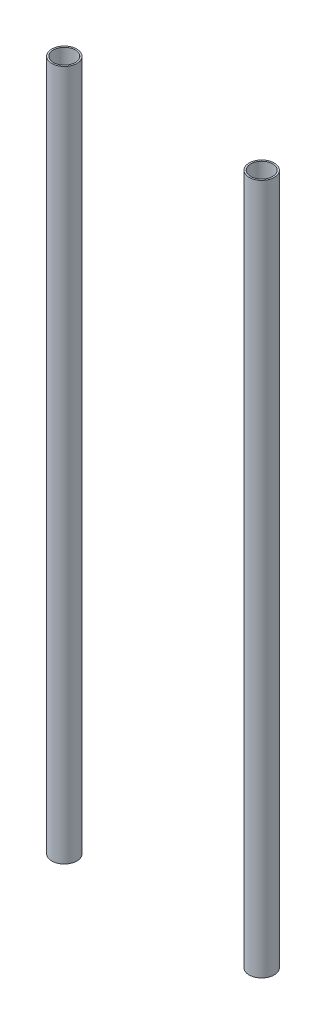
ISO-10303-21;
HEADER;
FILE_DESCRIPTION(('STEP AP214'),'2;1');
FILE_NAME('part.step','',(''),(''),'','','');
FILE_SCHEMA(('AUTOMOTIVE_DESIGN { 1 0 10303 214 1 1 1 1 }'));
ENDSEC;
DATA;
#1=APPLICATION_CONTEXT('core data for automotive mechanical design processes');
#2=APPLICATION_PROTOCOL_DEFINITION('international standard','automotive_design',2000,#1);
#3=PRODUCT_CONTEXT('',#1,'mechanical');
#4=PRODUCT('Part','Part','',(#3));
#5=PRODUCT_RELATED_PRODUCT_CATEGORY('part','',(#4));
#6=PRODUCT_DEFINITION_FORMATION('','',#4);
#7=PRODUCT_DEFINITION_CONTEXT('part definition',#1,'design');
#8=PRODUCT_DEFINITION('design','',#6,#7);
#9=PRODUCT_DEFINITION_SHAPE('','',#8);
#10=(LENGTH_UNIT() NAMED_UNIT(*) SI_UNIT(.MILLI.,.METRE.));
#11=(NAMED_UNIT(*) PLANE_ANGLE_UNIT() SI_UNIT($,.RADIAN.));
#12=(NAMED_UNIT(*) SI_UNIT($,.STERADIAN.) SOLID_ANGLE_UNIT());
#13=UNCERTAINTY_MEASURE_WITH_UNIT(LENGTH_MEASURE(1.E-05),#10,'distance_accuracy_value','');
#14=(GEOMETRIC_REPRESENTATION_CONTEXT(3) GLOBAL_UNCERTAINTY_ASSIGNED_CONTEXT((#13)) GLOBAL_UNIT_ASSIGNED_CONTEXT((#10,
#11,#12)) REPRESENTATION_CONTEXT('',''));
#15=CARTESIAN_POINT('',(0.,0.,0.));
#16=DIRECTION('',(0.,0.,1.));
#17=DIRECTION('',(1.,0.,0.));
#18=AXIS2_PLACEMENT_3D('',#15,#16,#17);
#19=CARTESIAN_POINT('',(100.,700.,0.));
#20=DIRECTION('',(0.,1.,0.));
#21=DIRECTION('',(0.,0.,1.));
#22=AXIS2_PLACEMENT_3D('',#19,#20,#21);
#23=PLANE('',#22);
#24=CARTESIAN_POINT('',(100.,700.,0.));
#25=DIRECTION('',(0.,1.,0.));
#26=DIRECTION('',(0.,0.,1.));
#27=AXIS2_PLACEMENT_3D('',#24,#25,#26);
#28=CIRCLE('',#27,12.7);
#29=CARTESIAN_POINT('',(100.,700.,12.7));
#30=VERTEX_POINT('',#29);
#31=EDGE_CURVE('E11',#30,#30,#28,.T.);
#32=ORIENTED_EDGE('',*,*,#31,.T.);
#33=EDGE_LOOP('',(#32));
#34=FACE_BOUND('',#33,.T.);
#35=CARTESIAN_POINT('',(100.,700.,0.));
#36=DIRECTION('',(0.,1.,0.));
#37=DIRECTION('',(0.,0.,1.));
#38=AXIS2_PLACEMENT_3D('',#35,#36,#37);
#39=CIRCLE('',#38,11.1);
#40=CARTESIAN_POINT('',(100.,700.,11.1));
#41=VERTEX_POINT('',#40);
#42=EDGE_CURVE('E52',#41,#41,#39,.T.);
#43=ORIENTED_EDGE('',*,*,#42,.F.);
#44=EDGE_LOOP('',(#43));
#45=FACE_BOUND('',#44,.T.);
#46=ADVANCED_FACE('F41',(#34,#45),#23,.T.);
#47=CARTESIAN_POINT('',(100.,0.,0.));
#48=DIRECTION('',(0.,1.,0.));
#49=DIRECTION('',(0.,0.,1.));
#50=AXIS2_PLACEMENT_3D('',#47,#48,#49);
#51=PLANE('',#50);
#52=CARTESIAN_POINT('',(100.,0.,0.));
#53=DIRECTION('',(0.,1.,0.));
#54=DIRECTION('',(0.,0.,1.));
#55=AXIS2_PLACEMENT_3D('',#52,#53,#54);
#56=CIRCLE('',#55,12.7);
#57=CARTESIAN_POINT('',(100.,0.,12.7));
#58=VERTEX_POINT('',#57);
#59=EDGE_CURVE('E45',#58,#58,#56,.T.);
#60=ORIENTED_EDGE('',*,*,#59,.F.);
#61=EDGE_LOOP('',(#60));
#62=FACE_BOUND('',#61,.T.);
#63=CARTESIAN_POINT('',(100.,0.,0.));
#64=DIRECTION('',(0.,1.,0.));
#65=DIRECTION('',(0.,0.,1.));
#66=AXIS2_PLACEMENT_3D('',#63,#64,#65);
#67=CIRCLE('',#66,11.1);
#68=CARTESIAN_POINT('',(100.,0.,11.1));
#69=VERTEX_POINT('',#68);
#70=EDGE_CURVE('E54',#69,#69,#67,.T.);
#71=ORIENTED_EDGE('',*,*,#70,.T.);
#72=EDGE_LOOP('',(#71));
#73=FACE_BOUND('',#72,.T.);
#74=ADVANCED_FACE('F64',(#62,#73),#51,.F.);
#75=CARTESIAN_POINT('',(100.,700.,0.));
#76=DIRECTION('',(0.,-1.,0.));
#77=DIRECTION('',(0.,0.,-1.));
#78=AXIS2_PLACEMENT_3D('',#75,#76,#77);
#79=CYLINDRICAL_SURFACE('',#78,12.7);
#80=ORIENTED_EDGE('',*,*,#31,.F.);
#81=EDGE_LOOP('',(#80));
#82=FACE_BOUND('',#81,.T.);
#83=ORIENTED_EDGE('',*,*,#59,.T.);
#84=EDGE_LOOP('',(#83));
#85=FACE_BOUND('',#84,.T.);
#86=ADVANCED_FACE('F43',(#82,#85),#79,.T.);
#87=CARTESIAN_POINT('',(100.,700.,0.));
#88=DIRECTION('',(0.,-1.,0.));
#89=DIRECTION('',(0.,0.,-1.));
#90=AXIS2_PLACEMENT_3D('',#87,#88,#89);
#91=CYLINDRICAL_SURFACE('',#90,11.1);
#92=ORIENTED_EDGE('',*,*,#42,.T.);
#93=EDGE_LOOP('',(#92));
#94=FACE_BOUND('',#93,.T.);
#95=ORIENTED_EDGE('',*,*,#70,.F.);
#96=EDGE_LOOP('',(#95));
#97=FACE_BOUND('',#96,.T.);
#98=ADVANCED_FACE('F60',(#94,#97),#91,.F.);
#99=CLOSED_SHELL('',(#46,#74,#86,#98));
#100=MANIFOLD_SOLID_BREP('B2',#99);
#101=CARTESIAN_POINT('',(-100.,700.,0.));
#102=DIRECTION('',(0.,1.,0.));
#103=DIRECTION('',(0.,0.,1.));
#104=AXIS2_PLACEMENT_3D('',#101,#102,#103);
#105=PLANE('',#104);
#106=CARTESIAN_POINT('',(-100.,700.,0.));
#107=DIRECTION('',(0.,1.,0.));
#108=DIRECTION('',(0.,0.,1.));
#109=AXIS2_PLACEMENT_3D('',#106,#107,#108);
#110=CIRCLE('',#109,12.7);
#111=CARTESIAN_POINT('',(-100.,700.,12.7));
#112=VERTEX_POINT('',#111);
#113=EDGE_CURVE('E40',#112,#112,#110,.T.);
#114=ORIENTED_EDGE('',*,*,#113,.T.);
#115=EDGE_LOOP('',(#114));
#116=FACE_BOUND('',#115,.T.);
#117=CARTESIAN_POINT('',(-100.,700.,0.));
#118=DIRECTION('',(0.,1.,0.));
#119=DIRECTION('',(0.,0.,1.));
#120=AXIS2_PLACEMENT_3D('',#117,#118,#119);
#121=CIRCLE('',#120,11.1);
#122=CARTESIAN_POINT('',(-100.,700.,11.1));
#123=VERTEX_POINT('',#122);
#124=EDGE_CURVE('E116',#123,#123,#121,.T.);
#125=ORIENTED_EDGE('',*,*,#124,.F.);
#126=EDGE_LOOP('',(#125));
#127=FACE_BOUND('',#126,.T.);
#128=ADVANCED_FACE('F105',(#116,#127),#105,.T.);
#129=CARTESIAN_POINT('',(-100.,0.,0.));
#130=DIRECTION('',(0.,1.,0.));
#131=DIRECTION('',(0.,0.,1.));
#132=AXIS2_PLACEMENT_3D('',#129,#130,#131);
#133=PLANE('',#132);
#134=CARTESIAN_POINT('',(-100.,0.,0.));
#135=DIRECTION('',(0.,1.,0.));
#136=DIRECTION('',(0.,0.,1.));
#137=AXIS2_PLACEMENT_3D('',#134,#135,#136);
#138=CIRCLE('',#137,12.7);
#139=CARTESIAN_POINT('',(-100.,0.,12.7));
#140=VERTEX_POINT('',#139);
#141=EDGE_CURVE('E109',#140,#140,#138,.T.);
#142=ORIENTED_EDGE('',*,*,#141,.F.);
#143=EDGE_LOOP('',(#142));
#144=FACE_BOUND('',#143,.T.);
#145=CARTESIAN_POINT('',(-100.,0.,0.));
#146=DIRECTION('',(0.,1.,0.));
#147=DIRECTION('',(0.,0.,1.));
#148=AXIS2_PLACEMENT_3D('',#145,#146,#147);
#149=CIRCLE('',#148,11.1);
#150=CARTESIAN_POINT('',(-100.,0.,11.1));
#151=VERTEX_POINT('',#150);
#152=EDGE_CURVE('E118',#151,#151,#149,.T.);
#153=ORIENTED_EDGE('',*,*,#152,.T.);
#154=EDGE_LOOP('',(#153));
#155=FACE_BOUND('',#154,.T.);
#156=ADVANCED_FACE('F128',(#144,#155),#133,.F.);
#157=CARTESIAN_POINT('',(-100.,700.,0.));
#158=DIRECTION('',(0.,-1.,0.));
#159=DIRECTION('',(0.,0.,-1.));
#160=AXIS2_PLACEMENT_3D('',#157,#158,#159);
#161=CYLINDRICAL_SURFACE('',#160,12.7);
#162=ORIENTED_EDGE('',*,*,#113,.F.);
#163=EDGE_LOOP('',(#162));
#164=FACE_BOUND('',#163,.T.);
#165=ORIENTED_EDGE('',*,*,#141,.T.);
#166=EDGE_LOOP('',(#165));
#167=FACE_BOUND('',#166,.T.);
#168=ADVANCED_FACE('F107',(#164,#167),#161,.T.);
#169=CARTESIAN_POINT('',(-100.,700.,0.));
#170=DIRECTION('',(0.,-1.,0.));
#171=DIRECTION('',(0.,0.,-1.));
#172=AXIS2_PLACEMENT_3D('',#169,#170,#171);
#173=CYLINDRICAL_SURFACE('',#172,11.1);
#174=ORIENTED_EDGE('',*,*,#124,.T.);
#175=EDGE_LOOP('',(#174));
#176=FACE_BOUND('',#175,.T.);
#177=ORIENTED_EDGE('',*,*,#152,.F.);
#178=EDGE_LOOP('',(#177));
#179=FACE_BOUND('',#178,.T.);
#180=ADVANCED_FACE('F124',(#176,#179),#173,.F.);
#181=CLOSED_SHELL('',(#128,#156,#168,#180));
#182=MANIFOLD_SOLID_BREP('B6',#181);
#183=ADVANCED_BREP_SHAPE_REPRESENTATION('',(#18,#100,#182),#14);
#184=SHAPE_DEFINITION_REPRESENTATION(#9,#183);
ENDSEC;
END-ISO-10303-21;
